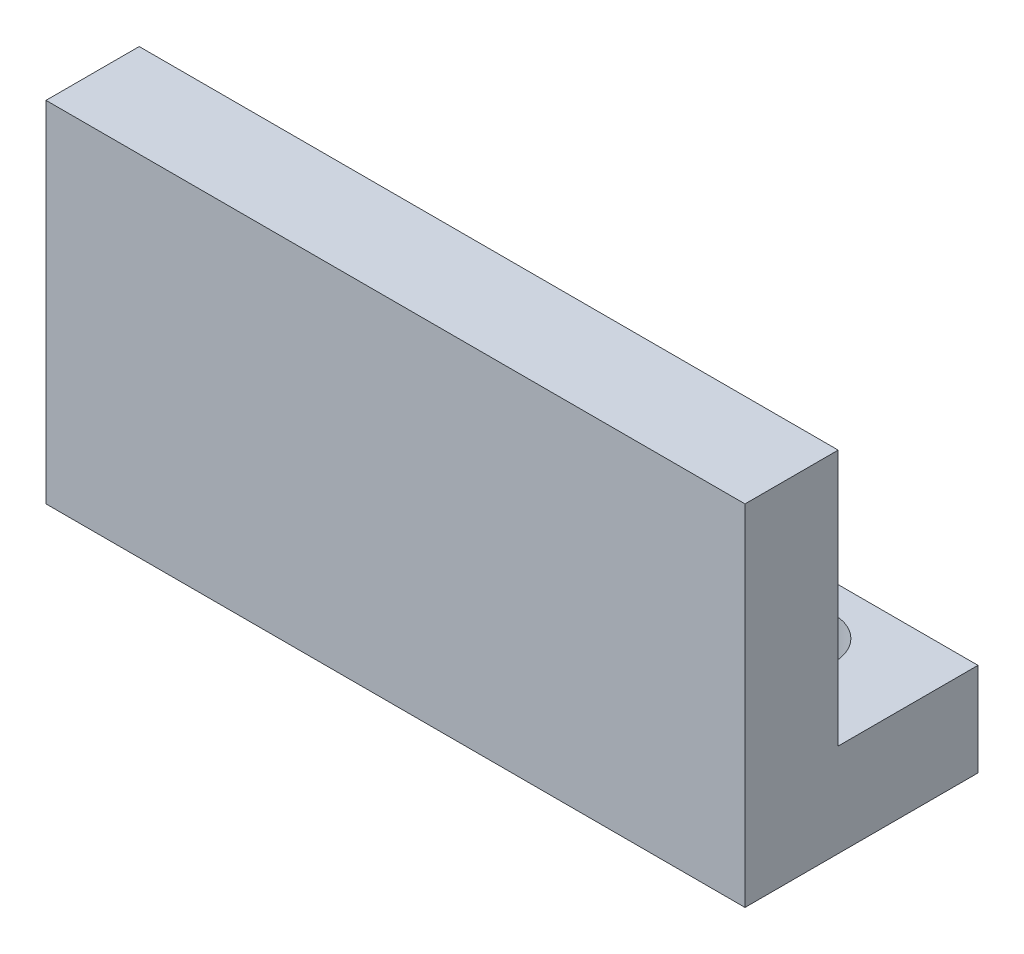
ISO-10303-21;
HEADER;
FILE_DESCRIPTION(('STEP AP214'),'2;1');
FILE_NAME('part.step','',(''),(''),'','','');
FILE_SCHEMA(('AUTOMOTIVE_DESIGN { 1 0 10303 214 1 1 1 1 }'));
ENDSEC;
DATA;
#1=APPLICATION_CONTEXT('core data for automotive mechanical design processes');
#2=APPLICATION_PROTOCOL_DEFINITION('international standard','automotive_design',2000,#1);
#3=PRODUCT_CONTEXT('',#1,'mechanical');
#4=PRODUCT('Part','Part','',(#3));
#5=PRODUCT_RELATED_PRODUCT_CATEGORY('part','',(#4));
#6=PRODUCT_DEFINITION_FORMATION('','',#4);
#7=PRODUCT_DEFINITION_CONTEXT('part definition',#1,'design');
#8=PRODUCT_DEFINITION('design','',#6,#7);
#9=PRODUCT_DEFINITION_SHAPE('','',#8);
#10=(LENGTH_UNIT() NAMED_UNIT(*) SI_UNIT(.MILLI.,.METRE.));
#11=(NAMED_UNIT(*) PLANE_ANGLE_UNIT() SI_UNIT($,.RADIAN.));
#12=(NAMED_UNIT(*) SI_UNIT($,.STERADIAN.) SOLID_ANGLE_UNIT());
#13=UNCERTAINTY_MEASURE_WITH_UNIT(LENGTH_MEASURE(1.E-05),#10,'distance_accuracy_value','');
#14=(GEOMETRIC_REPRESENTATION_CONTEXT(3) GLOBAL_UNCERTAINTY_ASSIGNED_CONTEXT((#13)) GLOBAL_UNIT_ASSIGNED_CONTEXT((#10,
#11,#12)) REPRESENTATION_CONTEXT('',''));
#15=CARTESIAN_POINT('',(0.,0.,0.));
#16=DIRECTION('',(0.,0.,1.));
#17=DIRECTION('',(1.,0.,0.));
#18=AXIS2_PLACEMENT_3D('',#15,#16,#17);
#19=CARTESIAN_POINT('',(30.,15.,0.));
#20=DIRECTION('',(0.,-1.,0.));
#21=DIRECTION('',(0.,0.,-1.));
#22=AXIS2_PLACEMENT_3D('',#19,#20,#21);
#23=PLANE('',#22);
#24=DIRECTION('',(0.,0.,1.));
#25=VECTOR('',#24,1.);
#26=CARTESIAN_POINT('',(0.,15.,0.));
#27=LINE('',#26,#25);
#28=CARTESIAN_POINT('',(0.,15.,-4.));
#29=VERTEX_POINT('',#28);
#30=CARTESIAN_POINT('',(0.,15.,0.));
#31=VERTEX_POINT('',#30);
#32=EDGE_CURVE('E117',#29,#31,#27,.T.);
#33=ORIENTED_EDGE('',*,*,#32,.T.);
#34=DIRECTION('',(-1.,0.,0.));
#35=VECTOR('',#34,1.);
#36=CARTESIAN_POINT('',(30.,15.,0.));
#37=LINE('',#36,#35);
#38=CARTESIAN_POINT('',(30.,15.,0.));
#39=VERTEX_POINT('',#38);
#40=EDGE_CURVE('E11',#39,#31,#37,.T.);
#41=ORIENTED_EDGE('',*,*,#40,.F.);
#42=DIRECTION('',(0.,0.,1.));
#43=VECTOR('',#42,1.);
#44=CARTESIAN_POINT('',(30.,15.,0.));
#45=LINE('',#44,#43);
#46=CARTESIAN_POINT('',(30.,15.,-4.));
#47=VERTEX_POINT('',#46);
#48=EDGE_CURVE('E128',#47,#39,#45,.T.);
#49=ORIENTED_EDGE('',*,*,#48,.F.);
#50=DIRECTION('',(-1.,0.,0.));
#51=VECTOR('',#50,1.);
#52=CARTESIAN_POINT('',(30.,15.,-4.));
#53=LINE('',#52,#51);
#54=EDGE_CURVE('E113',#47,#29,#53,.T.);
#55=ORIENTED_EDGE('',*,*,#54,.T.);
#56=EDGE_LOOP('',(#33,#41,#49,#55));
#57=FACE_BOUND('',#56,.T.);
#58=ADVANCED_FACE('F33',(#57),#23,.F.);
#59=CARTESIAN_POINT('',(30.,15.,0.));
#60=DIRECTION('',(0.,0.,-1.));
#61=DIRECTION('',(0.,1.,0.));
#62=AXIS2_PLACEMENT_3D('',#59,#60,#61);
#63=PLANE('',#62);
#64=DIRECTION('',(0.,-1.,0.));
#65=VECTOR('',#64,1.);
#66=CARTESIAN_POINT('',(0.,15.,0.));
#67=LINE('',#66,#65);
#68=CARTESIAN_POINT('',(0.,0.,0.));
#69=VERTEX_POINT('',#68);
#70=EDGE_CURVE('E120',#31,#69,#67,.T.);
#71=ORIENTED_EDGE('',*,*,#70,.T.);
#72=DIRECTION('',(-1.,0.,0.));
#73=VECTOR('',#72,1.);
#74=CARTESIAN_POINT('',(30.,0.,0.));
#75=LINE('',#74,#73);
#76=CARTESIAN_POINT('',(30.,0.,0.));
#77=VERTEX_POINT('',#76);
#78=EDGE_CURVE('E41',#77,#69,#75,.T.);
#79=ORIENTED_EDGE('',*,*,#78,.F.);
#80=DIRECTION('',(0.,-1.,0.));
#81=VECTOR('',#80,1.);
#82=CARTESIAN_POINT('',(30.,15.,0.));
#83=LINE('',#82,#81);
#84=EDGE_CURVE('E86',#39,#77,#83,.T.);
#85=ORIENTED_EDGE('',*,*,#84,.F.);
#86=ORIENTED_EDGE('',*,*,#40,.T.);
#87=EDGE_LOOP('',(#71,#79,#85,#86));
#88=FACE_BOUND('',#87,.T.);
#89=ADVANCED_FACE('F153',(#88),#63,.F.);
#90=CARTESIAN_POINT('',(30.,0.,0.));
#91=DIRECTION('',(0.,1.,0.));
#92=DIRECTION('',(0.,0.,1.));
#93=AXIS2_PLACEMENT_3D('',#90,#91,#92);
#94=PLANE('',#93);
#95=CARTESIAN_POINT('',(5.,0.,-7.));
#96=DIRECTION('',(0.,1.,0.));
#97=DIRECTION('',(0.,0.,1.));
#98=AXIS2_PLACEMENT_3D('',#95,#96,#97);
#99=CIRCLE('',#98,1.8);
#100=CARTESIAN_POINT('',(5.,0.,-5.2));
#101=VERTEX_POINT('',#100);
#102=EDGE_CURVE('E218',#101,#101,#99,.T.);
#103=ORIENTED_EDGE('',*,*,#102,.T.);
#104=EDGE_LOOP('',(#103));
#105=FACE_BOUND('',#104,.T.);
#106=CARTESIAN_POINT('',(25.,0.,-7.));
#107=DIRECTION('',(0.,1.,0.));
#108=DIRECTION('',(0.,0.,1.));
#109=AXIS2_PLACEMENT_3D('',#106,#107,#108);
#110=CIRCLE('',#109,1.8);
#111=CARTESIAN_POINT('',(25.,0.,-5.2));
#112=VERTEX_POINT('',#111);
#113=EDGE_CURVE('E121',#112,#112,#110,.T.);
#114=ORIENTED_EDGE('',*,*,#113,.T.);
#115=EDGE_LOOP('',(#114));
#116=FACE_BOUND('',#115,.T.);
#117=DIRECTION('',(0.,0.,-1.));
#118=VECTOR('',#117,1.);
#119=CARTESIAN_POINT('',(0.,0.,0.));
#120=LINE('',#119,#118);
#121=CARTESIAN_POINT('',(0.,0.,-10.));
#122=VERTEX_POINT('',#121);
#123=EDGE_CURVE('E123',#69,#122,#120,.T.);
#124=ORIENTED_EDGE('',*,*,#123,.T.);
#125=DIRECTION('',(-1.,0.,0.));
#126=VECTOR('',#125,1.);
#127=CARTESIAN_POINT('',(30.,0.,-10.));
#128=LINE('',#127,#126);
#129=CARTESIAN_POINT('',(30.,0.,-10.));
#130=VERTEX_POINT('',#129);
#131=EDGE_CURVE('E108',#130,#122,#128,.T.);
#132=ORIENTED_EDGE('',*,*,#131,.F.);
#133=DIRECTION('',(0.,0.,-1.));
#134=VECTOR('',#133,1.);
#135=CARTESIAN_POINT('',(30.,0.,0.));
#136=LINE('',#135,#134);
#137=EDGE_CURVE('E99',#77,#130,#136,.T.);
#138=ORIENTED_EDGE('',*,*,#137,.F.);
#139=ORIENTED_EDGE('',*,*,#78,.T.);
#140=EDGE_LOOP('',(#124,#132,#138,#139));
#141=FACE_BOUND('',#140,.T.);
#142=ADVANCED_FACE('F134',(#105,#116,#141),#94,.F.);
#143=CARTESIAN_POINT('',(30.,0.,-10.));
#144=DIRECTION('',(0.,0.,1.));
#145=DIRECTION('',(0.,-1.,0.));
#146=AXIS2_PLACEMENT_3D('',#143,#144,#145);
#147=PLANE('',#146);
#148=DIRECTION('',(0.,1.,0.));
#149=VECTOR('',#148,1.);
#150=CARTESIAN_POINT('',(0.,0.,-10.));
#151=LINE('',#150,#149);
#152=CARTESIAN_POINT('',(0.,4.,-10.));
#153=VERTEX_POINT('',#152);
#154=EDGE_CURVE('E107',#122,#153,#151,.T.);
#155=ORIENTED_EDGE('',*,*,#154,.T.);
#156=DIRECTION('',(-1.,0.,0.));
#157=VECTOR('',#156,1.);
#158=CARTESIAN_POINT('',(30.,4.,-10.));
#159=LINE('',#158,#157);
#160=CARTESIAN_POINT('',(30.,4.,-10.));
#161=VERTEX_POINT('',#160);
#162=EDGE_CURVE('E104',#161,#153,#159,.T.);
#163=ORIENTED_EDGE('',*,*,#162,.F.);
#164=DIRECTION('',(0.,1.,0.));
#165=VECTOR('',#164,1.);
#166=CARTESIAN_POINT('',(30.,0.,-10.));
#167=LINE('',#166,#165);
#168=EDGE_CURVE('E93',#130,#161,#167,.T.);
#169=ORIENTED_EDGE('',*,*,#168,.F.);
#170=ORIENTED_EDGE('',*,*,#131,.T.);
#171=EDGE_LOOP('',(#155,#163,#169,#170));
#172=FACE_BOUND('',#171,.T.);
#173=ADVANCED_FACE('F105',(#172),#147,.F.);
#174=CARTESIAN_POINT('',(30.,4.,-10.));
#175=DIRECTION('',(0.,-1.,0.));
#176=DIRECTION('',(0.,0.,-1.));
#177=AXIS2_PLACEMENT_3D('',#174,#175,#176);
#178=PLANE('',#177);
#179=CARTESIAN_POINT('',(5.,4.,-7.));
#180=DIRECTION('',(0.,1.,0.));
#181=DIRECTION('',(0.,0.,1.));
#182=AXIS2_PLACEMENT_3D('',#179,#180,#181);
#183=CIRCLE('',#182,1.8);
#184=CARTESIAN_POINT('',(5.,4.,-5.2));
#185=VERTEX_POINT('',#184);
#186=EDGE_CURVE('E221',#185,#185,#183,.T.);
#187=ORIENTED_EDGE('',*,*,#186,.F.);
#188=EDGE_LOOP('',(#187));
#189=FACE_BOUND('',#188,.T.);
#190=CARTESIAN_POINT('',(25.,4.,-7.));
#191=DIRECTION('',(0.,1.,0.));
#192=DIRECTION('',(0.,0.,1.));
#193=AXIS2_PLACEMENT_3D('',#190,#191,#192);
#194=CIRCLE('',#193,1.8);
#195=CARTESIAN_POINT('',(25.,4.,-5.2));
#196=VERTEX_POINT('',#195);
#197=EDGE_CURVE('E223',#196,#196,#194,.T.);
#198=ORIENTED_EDGE('',*,*,#197,.F.);
#199=EDGE_LOOP('',(#198));
#200=FACE_BOUND('',#199,.T.);
#201=DIRECTION('',(0.,0.,1.));
#202=VECTOR('',#201,1.);
#203=CARTESIAN_POINT('',(0.,4.,-10.));
#204=LINE('',#203,#202);
#205=CARTESIAN_POINT('',(0.,4.,-4.));
#206=VERTEX_POINT('',#205);
#207=EDGE_CURVE('E72',#153,#206,#204,.T.);
#208=ORIENTED_EDGE('',*,*,#207,.T.);
#209=DIRECTION('',(-1.,0.,0.));
#210=VECTOR('',#209,1.);
#211=CARTESIAN_POINT('',(30.,4.,-4.));
#212=LINE('',#211,#210);
#213=CARTESIAN_POINT('',(30.,4.,-4.));
#214=VERTEX_POINT('',#213);
#215=EDGE_CURVE('E109',#214,#206,#212,.T.);
#216=ORIENTED_EDGE('',*,*,#215,.F.);
#217=DIRECTION('',(0.,0.,1.));
#218=VECTOR('',#217,1.);
#219=CARTESIAN_POINT('',(30.,4.,-10.));
#220=LINE('',#219,#218);
#221=EDGE_CURVE('E97',#161,#214,#220,.T.);
#222=ORIENTED_EDGE('',*,*,#221,.F.);
#223=ORIENTED_EDGE('',*,*,#162,.T.);
#224=EDGE_LOOP('',(#208,#216,#222,#223));
#225=FACE_BOUND('',#224,.T.);
#226=ADVANCED_FACE('F111',(#189,#200,#225),#178,.F.);
#227=CARTESIAN_POINT('',(30.,4.,-4.));
#228=DIRECTION('',(0.,0.,1.));
#229=DIRECTION('',(1.,0.,0.));
#230=AXIS2_PLACEMENT_3D('',#227,#228,#229);
#231=PLANE('',#230);
#232=DIRECTION('',(0.,1.,0.));
#233=VECTOR('',#232,1.);
#234=CARTESIAN_POINT('',(0.,4.,-4.));
#235=LINE('',#234,#233);
#236=EDGE_CURVE('E78',#206,#29,#235,.T.);
#237=ORIENTED_EDGE('',*,*,#236,.T.);
#238=ORIENTED_EDGE('',*,*,#54,.F.);
#239=DIRECTION('',(0.,1.,0.));
#240=VECTOR('',#239,1.);
#241=CARTESIAN_POINT('',(30.,4.,-4.));
#242=LINE('',#241,#240);
#243=EDGE_CURVE('E49',#214,#47,#242,.T.);
#244=ORIENTED_EDGE('',*,*,#243,.F.);
#245=ORIENTED_EDGE('',*,*,#215,.T.);
#246=EDGE_LOOP('',(#237,#238,#244,#245));
#247=FACE_BOUND('',#246,.T.);
#248=ADVANCED_FACE('F141',(#247),#231,.F.);
#249=CARTESIAN_POINT('',(30.,0.,0.));
#250=DIRECTION('',(1.,0.,0.));
#251=DIRECTION('',(0.,0.,-1.));
#252=AXIS2_PLACEMENT_3D('',#249,#250,#251);
#253=PLANE('',#252);
#254=ORIENTED_EDGE('',*,*,#48,.T.);
#255=ORIENTED_EDGE('',*,*,#84,.T.);
#256=ORIENTED_EDGE('',*,*,#137,.T.);
#257=ORIENTED_EDGE('',*,*,#168,.T.);
#258=ORIENTED_EDGE('',*,*,#221,.T.);
#259=ORIENTED_EDGE('',*,*,#243,.T.);
#260=EDGE_LOOP('',(#254,#255,#256,#257,#258,#259));
#261=FACE_BOUND('',#260,.T.);
#262=ADVANCED_FACE('F95',(#261),#253,.T.);
#263=CARTESIAN_POINT('',(0.,0.,0.));
#264=DIRECTION('',(1.,0.,0.));
#265=DIRECTION('',(0.,0.,-1.));
#266=AXIS2_PLACEMENT_3D('',#263,#264,#265);
#267=PLANE('',#266);
#268=ORIENTED_EDGE('',*,*,#32,.F.);
#269=ORIENTED_EDGE('',*,*,#236,.F.);
#270=ORIENTED_EDGE('',*,*,#207,.F.);
#271=ORIENTED_EDGE('',*,*,#154,.F.);
#272=ORIENTED_EDGE('',*,*,#123,.F.);
#273=ORIENTED_EDGE('',*,*,#70,.F.);
#274=EDGE_LOOP('',(#268,#269,#270,#271,#272,#273));
#275=FACE_BOUND('',#274,.T.);
#276=ADVANCED_FACE('F137',(#275),#267,.F.);
#277=CARTESIAN_POINT('',(25.,4.,-7.));
#278=DIRECTION('',(0.,1.,0.));
#279=DIRECTION('',(0.,0.,1.));
#280=AXIS2_PLACEMENT_3D('',#277,#278,#279);
#281=CYLINDRICAL_SURFACE('',#280,1.8);
#282=ORIENTED_EDGE('',*,*,#113,.F.);
#283=EDGE_LOOP('',(#282));
#284=FACE_BOUND('',#283,.T.);
#285=ORIENTED_EDGE('',*,*,#197,.T.);
#286=EDGE_LOOP('',(#285));
#287=FACE_BOUND('',#286,.T.);
#288=ADVANCED_FACE('F181',(#284,#287),#281,.F.);
#289=CARTESIAN_POINT('',(5.,4.,-7.));
#290=DIRECTION('',(0.,1.,0.));
#291=DIRECTION('',(0.,0.,1.));
#292=AXIS2_PLACEMENT_3D('',#289,#290,#291);
#293=CYLINDRICAL_SURFACE('',#292,1.8);
#294=ORIENTED_EDGE('',*,*,#102,.F.);
#295=EDGE_LOOP('',(#294));
#296=FACE_BOUND('',#295,.T.);
#297=ORIENTED_EDGE('',*,*,#186,.T.);
#298=EDGE_LOOP('',(#297));
#299=FACE_BOUND('',#298,.T.);
#300=ADVANCED_FACE('F186',(#296,#299),#293,.F.);
#301=CLOSED_SHELL('',(#58,#89,#142,#173,#226,#248,#262,#276,#288,#300));
#302=MANIFOLD_SOLID_BREP('B2',#301);
#303=ADVANCED_BREP_SHAPE_REPRESENTATION('',(#18,#302),#14);
#304=SHAPE_DEFINITION_REPRESENTATION(#9,#303);
ENDSEC;
END-ISO-10303-21;
